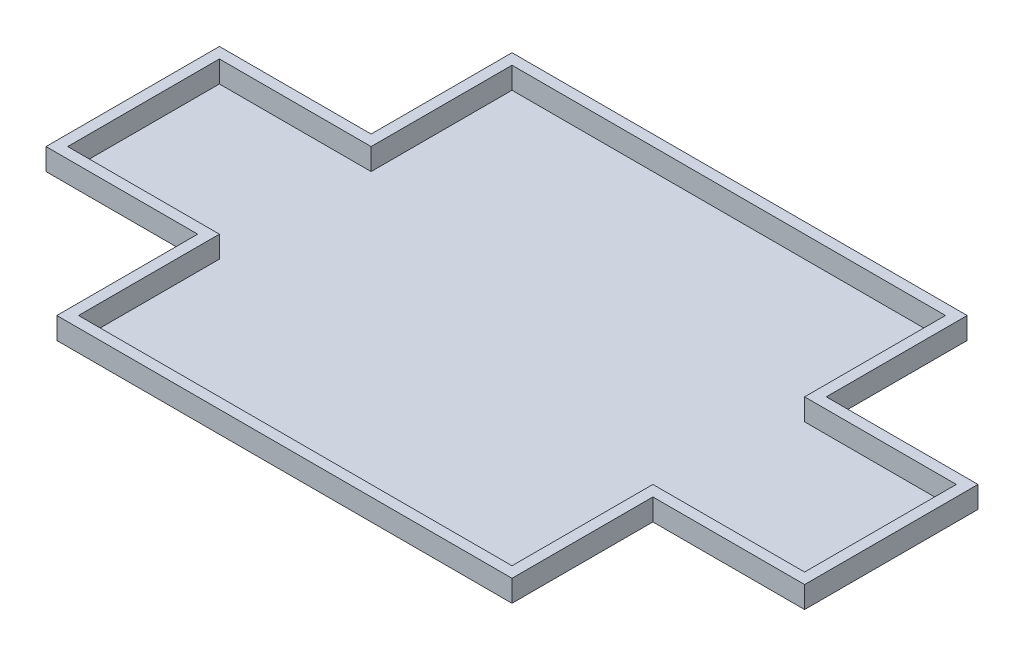
ISO-10303-21;
HEADER;
FILE_DESCRIPTION(('STEP AP214'),'2;1');
FILE_NAME('part.step','',(''),(''),'','','');
FILE_SCHEMA(('AUTOMOTIVE_DESIGN { 1 0 10303 214 1 1 1 1 }'));
ENDSEC;
DATA;
#1=APPLICATION_CONTEXT('core data for automotive mechanical design processes');
#2=APPLICATION_PROTOCOL_DEFINITION('international standard','automotive_design',2000,#1);
#3=PRODUCT_CONTEXT('',#1,'mechanical');
#4=PRODUCT('Part','Part','',(#3));
#5=PRODUCT_RELATED_PRODUCT_CATEGORY('part','',(#4));
#6=PRODUCT_DEFINITION_FORMATION('','',#4);
#7=PRODUCT_DEFINITION_CONTEXT('part definition',#1,'design');
#8=PRODUCT_DEFINITION('design','',#6,#7);
#9=PRODUCT_DEFINITION_SHAPE('','',#8);
#10=(LENGTH_UNIT() NAMED_UNIT(*) SI_UNIT(.MILLI.,.METRE.));
#11=(NAMED_UNIT(*) PLANE_ANGLE_UNIT() SI_UNIT($,.RADIAN.));
#12=(NAMED_UNIT(*) SI_UNIT($,.STERADIAN.) SOLID_ANGLE_UNIT());
#13=UNCERTAINTY_MEASURE_WITH_UNIT(LENGTH_MEASURE(1.E-05),#10,'distance_accuracy_value','');
#14=(GEOMETRIC_REPRESENTATION_CONTEXT(3) GLOBAL_UNCERTAINTY_ASSIGNED_CONTEXT((#13)) GLOBAL_UNIT_ASSIGNED_CONTEXT((#10,
#11,#12)) REPRESENTATION_CONTEXT('',''));
#15=CARTESIAN_POINT('',(0.,0.,0.));
#16=DIRECTION('',(0.,0.,1.));
#17=DIRECTION('',(1.,0.,0.));
#18=AXIS2_PLACEMENT_3D('',#15,#16,#17);
#19=CARTESIAN_POINT('',(0.,120.,0.));
#20=DIRECTION('',(0.,-1.,0.));
#21=DIRECTION('',(0.,0.,-1.));
#22=AXIS2_PLACEMENT_3D('',#19,#20,#21);
#23=PLANE('',#22);
#24=DIRECTION('',(1.,0.,0.));
#25=VECTOR('',#24,1.);
#26=CARTESIAN_POINT('',(-50.,120.,-600.));
#27=LINE('',#26,#25);
#28=CARTESIAN_POINT('',(-750.,120.,-600.));
#29=VERTEX_POINT('',#28);
#30=CARTESIAN_POINT('',(-50.,120.,-600.));
#31=VERTEX_POINT('',#30);
#32=EDGE_CURVE('E297',#29,#31,#27,.T.);
#33=ORIENTED_EDGE('',*,*,#32,.T.);
#34=DIRECTION('',(0.,0.,1.));
#35=VECTOR('',#34,1.);
#36=CARTESIAN_POINT('',(-50.,120.,49.9999999999998));
#37=LINE('',#36,#35);
#38=CARTESIAN_POINT('',(-50.,120.,49.9999999999998));
#39=VERTEX_POINT('',#38);
#40=EDGE_CURVE('E300',#31,#39,#37,.T.);
#41=ORIENTED_EDGE('',*,*,#40,.T.);
#42=DIRECTION('',(1.,0.,0.));
#43=VECTOR('',#42,1.);
#44=CARTESIAN_POINT('',(2050.,120.,49.9999999999996));
#45=LINE('',#44,#43);
#46=CARTESIAN_POINT('',(2050.,120.,49.9999999999996));
#47=VERTEX_POINT('',#46);
#48=EDGE_CURVE('E303',#39,#47,#45,.T.);
#49=ORIENTED_EDGE('',*,*,#48,.T.);
#50=DIRECTION('',(0.,0.,-1.));
#51=VECTOR('',#50,1.);
#52=CARTESIAN_POINT('',(2050.,120.,-600.));
#53=LINE('',#52,#51);
#54=CARTESIAN_POINT('',(2050.,120.,-600.));
#55=VERTEX_POINT('',#54);
#56=EDGE_CURVE('E305',#47,#55,#53,.T.);
#57=ORIENTED_EDGE('',*,*,#56,.T.);
#58=DIRECTION('',(1.,0.,0.));
#59=VECTOR('',#58,1.);
#60=CARTESIAN_POINT('',(2750.,120.,-600.));
#61=LINE('',#60,#59);
#62=CARTESIAN_POINT('',(2750.,120.,-600.));
#63=VERTEX_POINT('',#62);
#64=EDGE_CURVE('E307',#55,#63,#61,.T.);
#65=ORIENTED_EDGE('',*,*,#64,.T.);
#66=DIRECTION('',(0.,0.,-1.));
#67=VECTOR('',#66,1.);
#68=CARTESIAN_POINT('',(2750.,120.,-1400.));
#69=LINE('',#68,#67);
#70=CARTESIAN_POINT('',(2750.,120.,-1400.));
#71=VERTEX_POINT('',#70);
#72=EDGE_CURVE('E309',#63,#71,#69,.T.);
#73=ORIENTED_EDGE('',*,*,#72,.T.);
#74=DIRECTION('',(-1.,0.,0.));
#75=VECTOR('',#74,1.);
#76=CARTESIAN_POINT('',(2050.,120.,-1400.));
#77=LINE('',#76,#75);
#78=CARTESIAN_POINT('',(2050.,120.,-1400.));
#79=VERTEX_POINT('',#78);
#80=EDGE_CURVE('E311',#71,#79,#77,.T.);
#81=ORIENTED_EDGE('',*,*,#80,.T.);
#82=DIRECTION('',(0.,0.,-1.));
#83=VECTOR('',#82,1.);
#84=CARTESIAN_POINT('',(2050.,120.,-2050.));
#85=LINE('',#84,#83);
#86=CARTESIAN_POINT('',(2050.,120.,-2050.));
#87=VERTEX_POINT('',#86);
#88=EDGE_CURVE('E313',#79,#87,#85,.T.);
#89=ORIENTED_EDGE('',*,*,#88,.T.);
#90=DIRECTION('',(-1.,0.,0.));
#91=VECTOR('',#90,1.);
#92=CARTESIAN_POINT('',(-50.,120.,-2050.));
#93=LINE('',#92,#91);
#94=CARTESIAN_POINT('',(-50.,120.,-2050.));
#95=VERTEX_POINT('',#94);
#96=EDGE_CURVE('E315',#87,#95,#93,.T.);
#97=ORIENTED_EDGE('',*,*,#96,.T.);
#98=DIRECTION('',(0.,0.,1.));
#99=VECTOR('',#98,1.);
#100=CARTESIAN_POINT('',(-50.,120.,-1400.));
#101=LINE('',#100,#99);
#102=CARTESIAN_POINT('',(-50.,120.,-1400.));
#103=VERTEX_POINT('',#102);
#104=EDGE_CURVE('E317',#95,#103,#101,.T.);
#105=ORIENTED_EDGE('',*,*,#104,.T.);
#106=DIRECTION('',(-1.,0.,0.));
#107=VECTOR('',#106,1.);
#108=CARTESIAN_POINT('',(-750.,120.,-1400.));
#109=LINE('',#108,#107);
#110=CARTESIAN_POINT('',(-750.,120.,-1400.));
#111=VERTEX_POINT('',#110);
#112=EDGE_CURVE('E319',#103,#111,#109,.T.);
#113=ORIENTED_EDGE('',*,*,#112,.T.);
#114=DIRECTION('',(0.,0.,1.));
#115=VECTOR('',#114,1.);
#116=CARTESIAN_POINT('',(-750.,120.,-600.));
#117=LINE('',#116,#115);
#118=EDGE_CURVE('E321',#111,#29,#117,.T.);
#119=ORIENTED_EDGE('',*,*,#118,.T.);
#120=EDGE_LOOP('',(#33,#41,#49,#57,#65,#73,#81,#89,#97,#105,#113,#119));
#121=FACE_BOUND('',#120,.T.);
#122=DIRECTION('',(0.,0.,1.));
#123=VECTOR('',#122,1.);
#124=CARTESIAN_POINT('',(-700.,120.,-650.));
#125=LINE('',#124,#123);
#126=CARTESIAN_POINT('',(-700.,120.,-1350.));
#127=VERTEX_POINT('',#126);
#128=CARTESIAN_POINT('',(-700.,120.,-650.));
#129=VERTEX_POINT('',#128);
#130=EDGE_CURVE('E204',#127,#129,#125,.T.);
#131=ORIENTED_EDGE('',*,*,#130,.F.);
#132=DIRECTION('',(-1.,0.,0.));
#133=VECTOR('',#132,1.);
#134=CARTESIAN_POINT('',(-700.,120.,-1350.));
#135=LINE('',#134,#133);
#136=CARTESIAN_POINT('',(0.,120.,-1350.));
#137=VERTEX_POINT('',#136);
#138=EDGE_CURVE('E245',#137,#127,#135,.T.);
#139=ORIENTED_EDGE('',*,*,#138,.F.);
#140=DIRECTION('',(0.,0.,1.));
#141=VECTOR('',#140,1.);
#142=CARTESIAN_POINT('',(0.,120.,-1350.));
#143=LINE('',#142,#141);
#144=CARTESIAN_POINT('',(0.,120.,-2000.));
#145=VERTEX_POINT('',#144);
#146=EDGE_CURVE('E243',#145,#137,#143,.T.);
#147=ORIENTED_EDGE('',*,*,#146,.F.);
#148=DIRECTION('',(-1.,0.,0.));
#149=VECTOR('',#148,1.);
#150=CARTESIAN_POINT('',(0.,120.,-2000.));
#151=LINE('',#150,#149);
#152=CARTESIAN_POINT('',(2000.,120.,-2000.));
#153=VERTEX_POINT('',#152);
#154=EDGE_CURVE('E241',#153,#145,#151,.T.);
#155=ORIENTED_EDGE('',*,*,#154,.F.);
#156=DIRECTION('',(0.,0.,-1.));
#157=VECTOR('',#156,1.);
#158=CARTESIAN_POINT('',(2000.,120.,-2000.));
#159=LINE('',#158,#157);
#160=CARTESIAN_POINT('',(2000.,120.,-1350.));
#161=VERTEX_POINT('',#160);
#162=EDGE_CURVE('E239',#161,#153,#159,.T.);
#163=ORIENTED_EDGE('',*,*,#162,.F.);
#164=DIRECTION('',(-1.,0.,0.));
#165=VECTOR('',#164,1.);
#166=CARTESIAN_POINT('',(2000.,120.,-1350.));
#167=LINE('',#166,#165);
#168=CARTESIAN_POINT('',(2700.,120.,-1350.));
#169=VERTEX_POINT('',#168);
#170=EDGE_CURVE('E237',#169,#161,#167,.T.);
#171=ORIENTED_EDGE('',*,*,#170,.F.);
#172=DIRECTION('',(0.,0.,-1.));
#173=VECTOR('',#172,1.);
#174=CARTESIAN_POINT('',(2700.,120.,-1350.));
#175=LINE('',#174,#173);
#176=CARTESIAN_POINT('',(2700.,120.,-650.));
#177=VERTEX_POINT('',#176);
#178=EDGE_CURVE('E235',#177,#169,#175,.T.);
#179=ORIENTED_EDGE('',*,*,#178,.F.);
#180=DIRECTION('',(1.,0.,0.));
#181=VECTOR('',#180,1.);
#182=CARTESIAN_POINT('',(2700.,120.,-650.));
#183=LINE('',#182,#181);
#184=CARTESIAN_POINT('',(2000.,120.,-650.));
#185=VERTEX_POINT('',#184);
#186=EDGE_CURVE('E233',#185,#177,#183,.T.);
#187=ORIENTED_EDGE('',*,*,#186,.F.);
#188=DIRECTION('',(0.,0.,-1.));
#189=VECTOR('',#188,1.);
#190=CARTESIAN_POINT('',(2000.,120.,-650.));
#191=LINE('',#190,#189);
#192=CARTESIAN_POINT('',(2000.,120.,0.));
#193=VERTEX_POINT('',#192);
#194=EDGE_CURVE('E231',#193,#185,#191,.T.);
#195=ORIENTED_EDGE('',*,*,#194,.F.);
#196=DIRECTION('',(1.,0.,0.));
#197=VECTOR('',#196,1.);
#198=CARTESIAN_POINT('',(2000.,120.,0.));
#199=LINE('',#198,#197);
#200=CARTESIAN_POINT('',(0.,120.,0.));
#201=VERTEX_POINT('',#200);
#202=EDGE_CURVE('E227',#201,#193,#199,.T.);
#203=ORIENTED_EDGE('',*,*,#202,.F.);
#204=DIRECTION('',(0.,0.,1.));
#205=VECTOR('',#204,1.);
#206=CARTESIAN_POINT('',(0.,120.,0.));
#207=LINE('',#206,#205);
#208=CARTESIAN_POINT('',(0.,120.,-650.));
#209=VERTEX_POINT('',#208);
#210=EDGE_CURVE('E225',#209,#201,#207,.T.);
#211=ORIENTED_EDGE('',*,*,#210,.F.);
#212=DIRECTION('',(1.,0.,0.));
#213=VECTOR('',#212,1.);
#214=CARTESIAN_POINT('',(0.,120.,-650.));
#215=LINE('',#214,#213);
#216=EDGE_CURVE('E212',#129,#209,#215,.T.);
#217=ORIENTED_EDGE('',*,*,#216,.F.);
#218=EDGE_LOOP('',(#131,#139,#147,#155,#163,#171,#179,#187,#195,#203,#211,#217));
#219=FACE_BOUND('',#218,.T.);
#220=ADVANCED_FACE('F43',(#121,#219),#23,.F.);
#221=CARTESIAN_POINT('',(0.,20.,0.));
#222=DIRECTION('',(0.,-1.,0.));
#223=DIRECTION('',(0.,0.,-1.));
#224=AXIS2_PLACEMENT_3D('',#221,#222,#223);
#225=PLANE('',#224);
#226=DIRECTION('',(1.,0.,0.));
#227=VECTOR('',#226,1.);
#228=CARTESIAN_POINT('',(-50.,20.,-600.));
#229=LINE('',#228,#227);
#230=CARTESIAN_POINT('',(-750.,20.,-600.));
#231=VERTEX_POINT('',#230);
#232=CARTESIAN_POINT('',(-50.,20.,-600.));
#233=VERTEX_POINT('',#232);
#234=EDGE_CURVE('E220',#231,#233,#229,.T.);
#235=ORIENTED_EDGE('',*,*,#234,.F.);
#236=DIRECTION('',(0.,0.,1.));
#237=VECTOR('',#236,1.);
#238=CARTESIAN_POINT('',(-750.,20.,-600.));
#239=LINE('',#238,#237);
#240=CARTESIAN_POINT('',(-750.,20.,-1400.));
#241=VERTEX_POINT('',#240);
#242=EDGE_CURVE('E301',#241,#231,#239,.T.);
#243=ORIENTED_EDGE('',*,*,#242,.F.);
#244=DIRECTION('',(-1.,0.,0.));
#245=VECTOR('',#244,1.);
#246=CARTESIAN_POINT('',(-750.,20.,-1400.));
#247=LINE('',#246,#245);
#248=CARTESIAN_POINT('',(-50.,20.,-1400.));
#249=VERTEX_POINT('',#248);
#250=EDGE_CURVE('E344',#249,#241,#247,.T.);
#251=ORIENTED_EDGE('',*,*,#250,.F.);
#252=DIRECTION('',(0.,0.,1.));
#253=VECTOR('',#252,1.);
#254=CARTESIAN_POINT('',(-50.,20.,-1400.));
#255=LINE('',#254,#253);
#256=CARTESIAN_POINT('',(-50.,20.,-2050.));
#257=VERTEX_POINT('',#256);
#258=EDGE_CURVE('E342',#257,#249,#255,.T.);
#259=ORIENTED_EDGE('',*,*,#258,.F.);
#260=DIRECTION('',(-1.,0.,0.));
#261=VECTOR('',#260,1.);
#262=CARTESIAN_POINT('',(-50.,20.,-2050.));
#263=LINE('',#262,#261);
#264=CARTESIAN_POINT('',(2050.,20.,-2050.));
#265=VERTEX_POINT('',#264);
#266=EDGE_CURVE('E340',#265,#257,#263,.T.);
#267=ORIENTED_EDGE('',*,*,#266,.F.);
#268=DIRECTION('',(0.,0.,-1.));
#269=VECTOR('',#268,1.);
#270=CARTESIAN_POINT('',(2050.,20.,-2050.));
#271=LINE('',#270,#269);
#272=CARTESIAN_POINT('',(2050.,20.,-1400.));
#273=VERTEX_POINT('',#272);
#274=EDGE_CURVE('E338',#273,#265,#271,.T.);
#275=ORIENTED_EDGE('',*,*,#274,.F.);
#276=DIRECTION('',(-1.,0.,0.));
#277=VECTOR('',#276,1.);
#278=CARTESIAN_POINT('',(2050.,20.,-1400.));
#279=LINE('',#278,#277);
#280=CARTESIAN_POINT('',(2750.,20.,-1400.));
#281=VERTEX_POINT('',#280);
#282=EDGE_CURVE('E336',#281,#273,#279,.T.);
#283=ORIENTED_EDGE('',*,*,#282,.F.);
#284=DIRECTION('',(0.,0.,-1.));
#285=VECTOR('',#284,1.);
#286=CARTESIAN_POINT('',(2750.,20.,-1400.));
#287=LINE('',#286,#285);
#288=CARTESIAN_POINT('',(2750.,20.,-600.));
#289=VERTEX_POINT('',#288);
#290=EDGE_CURVE('E334',#289,#281,#287,.T.);
#291=ORIENTED_EDGE('',*,*,#290,.F.);
#292=DIRECTION('',(1.,0.,0.));
#293=VECTOR('',#292,1.);
#294=CARTESIAN_POINT('',(2750.,20.,-600.));
#295=LINE('',#294,#293);
#296=CARTESIAN_POINT('',(2050.,20.,-600.));
#297=VERTEX_POINT('',#296);
#298=EDGE_CURVE('E332',#297,#289,#295,.T.);
#299=ORIENTED_EDGE('',*,*,#298,.F.);
#300=DIRECTION('',(0.,0.,-1.));
#301=VECTOR('',#300,1.);
#302=CARTESIAN_POINT('',(2050.,20.,-600.));
#303=LINE('',#302,#301);
#304=CARTESIAN_POINT('',(2050.,20.,49.9999999999996));
#305=VERTEX_POINT('',#304);
#306=EDGE_CURVE('E330',#305,#297,#303,.T.);
#307=ORIENTED_EDGE('',*,*,#306,.F.);
#308=DIRECTION('',(1.,0.,0.));
#309=VECTOR('',#308,1.);
#310=CARTESIAN_POINT('',(2050.,20.,49.9999999999996));
#311=LINE('',#310,#309);
#312=CARTESIAN_POINT('',(-50.,20.,49.9999999999998));
#313=VERTEX_POINT('',#312);
#314=EDGE_CURVE('E328',#313,#305,#311,.T.);
#315=ORIENTED_EDGE('',*,*,#314,.F.);
#316=DIRECTION('',(0.,0.,1.));
#317=VECTOR('',#316,1.);
#318=CARTESIAN_POINT('',(-50.,20.,49.9999999999998));
#319=LINE('',#318,#317);
#320=EDGE_CURVE('E326',#233,#313,#319,.T.);
#321=ORIENTED_EDGE('',*,*,#320,.F.);
#322=EDGE_LOOP('',(#235,#243,#251,#259,#267,#275,#283,#291,#299,#307,#315,#321));
#323=FACE_BOUND('',#322,.T.);
#324=DIRECTION('',(-1.,0.,0.));
#325=VECTOR('',#324,1.);
#326=CARTESIAN_POINT('',(-700.,20.,-1350.));
#327=LINE('',#326,#325);
#328=CARTESIAN_POINT('',(0.,20.,-1350.));
#329=VERTEX_POINT('',#328);
#330=CARTESIAN_POINT('',(-700.,20.,-1350.));
#331=VERTEX_POINT('',#330);
#332=EDGE_CURVE('E213',#329,#331,#327,.T.);
#333=ORIENTED_EDGE('',*,*,#332,.T.);
#334=DIRECTION('',(0.,0.,1.));
#335=VECTOR('',#334,1.);
#336=CARTESIAN_POINT('',(-700.,20.,-650.));
#337=LINE('',#336,#335);
#338=CARTESIAN_POINT('',(-700.,20.,-650.));
#339=VERTEX_POINT('',#338);
#340=EDGE_CURVE('E66',#331,#339,#337,.T.);
#341=ORIENTED_EDGE('',*,*,#340,.T.);
#342=DIRECTION('',(1.,0.,0.));
#343=VECTOR('',#342,1.);
#344=CARTESIAN_POINT('',(0.,20.,-650.));
#345=LINE('',#344,#343);
#346=CARTESIAN_POINT('',(0.,20.,-650.));
#347=VERTEX_POINT('',#346);
#348=EDGE_CURVE('E219',#339,#347,#345,.T.);
#349=ORIENTED_EDGE('',*,*,#348,.T.);
#350=DIRECTION('',(0.,0.,1.));
#351=VECTOR('',#350,1.);
#352=CARTESIAN_POINT('',(0.,20.,0.));
#353=LINE('',#352,#351);
#354=CARTESIAN_POINT('',(0.,20.,0.));
#355=VERTEX_POINT('',#354);
#356=EDGE_CURVE('E249',#347,#355,#353,.T.);
#357=ORIENTED_EDGE('',*,*,#356,.T.);
#358=DIRECTION('',(1.,0.,0.));
#359=VECTOR('',#358,1.);
#360=CARTESIAN_POINT('',(2000.,20.,0.));
#361=LINE('',#360,#359);
#362=CARTESIAN_POINT('',(2000.,20.,0.));
#363=VERTEX_POINT('',#362);
#364=EDGE_CURVE('E252',#355,#363,#361,.T.);
#365=ORIENTED_EDGE('',*,*,#364,.T.);
#366=DIRECTION('',(0.,0.,-1.));
#367=VECTOR('',#366,1.);
#368=CARTESIAN_POINT('',(2000.,20.,-650.));
#369=LINE('',#368,#367);
#370=CARTESIAN_POINT('',(2000.,20.,-650.));
#371=VERTEX_POINT('',#370);
#372=EDGE_CURVE('E255',#363,#371,#369,.T.);
#373=ORIENTED_EDGE('',*,*,#372,.T.);
#374=DIRECTION('',(1.,0.,0.));
#375=VECTOR('',#374,1.);
#376=CARTESIAN_POINT('',(2700.,20.,-650.));
#377=LINE('',#376,#375);
#378=CARTESIAN_POINT('',(2700.,20.,-650.));
#379=VERTEX_POINT('',#378);
#380=EDGE_CURVE('E258',#371,#379,#377,.T.);
#381=ORIENTED_EDGE('',*,*,#380,.T.);
#382=DIRECTION('',(0.,0.,-1.));
#383=VECTOR('',#382,1.);
#384=CARTESIAN_POINT('',(2700.,20.,-1350.));
#385=LINE('',#384,#383);
#386=CARTESIAN_POINT('',(2700.,20.,-1350.));
#387=VERTEX_POINT('',#386);
#388=EDGE_CURVE('E261',#379,#387,#385,.T.);
#389=ORIENTED_EDGE('',*,*,#388,.T.);
#390=DIRECTION('',(-1.,0.,0.));
#391=VECTOR('',#390,1.);
#392=CARTESIAN_POINT('',(2000.,20.,-1350.));
#393=LINE('',#392,#391);
#394=CARTESIAN_POINT('',(2000.,20.,-1350.));
#395=VERTEX_POINT('',#394);
#396=EDGE_CURVE('E264',#387,#395,#393,.T.);
#397=ORIENTED_EDGE('',*,*,#396,.T.);
#398=DIRECTION('',(0.,0.,-1.));
#399=VECTOR('',#398,1.);
#400=CARTESIAN_POINT('',(2000.,20.,-2000.));
#401=LINE('',#400,#399);
#402=CARTESIAN_POINT('',(2000.,20.,-2000.));
#403=VERTEX_POINT('',#402);
#404=EDGE_CURVE('E267',#395,#403,#401,.T.);
#405=ORIENTED_EDGE('',*,*,#404,.T.);
#406=DIRECTION('',(-1.,0.,0.));
#407=VECTOR('',#406,1.);
#408=CARTESIAN_POINT('',(0.,20.,-2000.));
#409=LINE('',#408,#407);
#410=CARTESIAN_POINT('',(0.,20.,-2000.));
#411=VERTEX_POINT('',#410);
#412=EDGE_CURVE('E270',#403,#411,#409,.T.);
#413=ORIENTED_EDGE('',*,*,#412,.T.);
#414=DIRECTION('',(0.,0.,1.));
#415=VECTOR('',#414,1.);
#416=CARTESIAN_POINT('',(0.,20.,-1350.));
#417=LINE('',#416,#415);
#418=EDGE_CURVE('E273',#411,#329,#417,.T.);
#419=ORIENTED_EDGE('',*,*,#418,.T.);
#420=EDGE_LOOP('',(#333,#341,#349,#357,#365,#373,#381,#389,#397,#405,#413,#419));
#421=FACE_BOUND('',#420,.T.);
#422=ADVANCED_FACE('F386',(#323,#421),#225,.T.);
#423=CARTESIAN_POINT('',(-50.,120.,-600.));
#424=DIRECTION('',(0.,0.,-1.));
#425=DIRECTION('',(-1.,0.,0.));
#426=AXIS2_PLACEMENT_3D('',#423,#424,#425);
#427=PLANE('',#426);
#428=ORIENTED_EDGE('',*,*,#234,.T.);
#429=DIRECTION('',(0.,-1.,0.));
#430=VECTOR('',#429,1.);
#431=CARTESIAN_POINT('',(-50.,120.,-600.));
#432=LINE('',#431,#430);
#433=EDGE_CURVE('E12',#31,#233,#432,.T.);
#434=ORIENTED_EDGE('',*,*,#433,.F.);
#435=ORIENTED_EDGE('',*,*,#32,.F.);
#436=DIRECTION('',(0.,-1.,0.));
#437=VECTOR('',#436,1.);
#438=CARTESIAN_POINT('',(-750.,120.,-600.));
#439=LINE('',#438,#437);
#440=EDGE_CURVE('E323',#29,#231,#439,.T.);
#441=ORIENTED_EDGE('',*,*,#440,.T.);
#442=EDGE_LOOP('',(#428,#434,#435,#441));
#443=FACE_BOUND('',#442,.T.);
#444=ADVANCED_FACE('F45',(#443),#427,.F.);
#445=CARTESIAN_POINT('',(-50.,120.,49.9999999999998));
#446=DIRECTION('',(1.,0.,0.));
#447=DIRECTION('',(0.,0.,-1.));
#448=AXIS2_PLACEMENT_3D('',#445,#446,#447);
#449=PLANE('',#448);
#450=ORIENTED_EDGE('',*,*,#320,.T.);
#451=DIRECTION('',(0.,-1.,0.));
#452=VECTOR('',#451,1.);
#453=CARTESIAN_POINT('',(-50.,120.,49.9999999999998));
#454=LINE('',#453,#452);
#455=EDGE_CURVE('E51',#39,#313,#454,.T.);
#456=ORIENTED_EDGE('',*,*,#455,.F.);
#457=ORIENTED_EDGE('',*,*,#40,.F.);
#458=ORIENTED_EDGE('',*,*,#433,.T.);
#459=EDGE_LOOP('',(#450,#456,#457,#458));
#460=FACE_BOUND('',#459,.T.);
#461=ADVANCED_FACE('F403',(#460),#449,.F.);
#462=CARTESIAN_POINT('',(2050.,120.,49.9999999999996));
#463=DIRECTION('',(0.,0.,-1.));
#464=DIRECTION('',(-1.,0.,0.));
#465=AXIS2_PLACEMENT_3D('',#462,#463,#464);
#466=PLANE('',#465);
#467=ORIENTED_EDGE('',*,*,#314,.T.);
#468=DIRECTION('',(0.,-1.,0.));
#469=VECTOR('',#468,1.);
#470=CARTESIAN_POINT('',(2050.,120.,49.9999999999996));
#471=LINE('',#470,#469);
#472=EDGE_CURVE('E373',#47,#305,#471,.T.);
#473=ORIENTED_EDGE('',*,*,#472,.F.);
#474=ORIENTED_EDGE('',*,*,#48,.F.);
#475=ORIENTED_EDGE('',*,*,#455,.T.);
#476=EDGE_LOOP('',(#467,#473,#474,#475));
#477=FACE_BOUND('',#476,.T.);
#478=ADVANCED_FACE('F380',(#477),#466,.F.);
#479=CARTESIAN_POINT('',(2050.,120.,-600.));
#480=DIRECTION('',(-1.,0.,0.));
#481=DIRECTION('',(0.,0.,1.));
#482=AXIS2_PLACEMENT_3D('',#479,#480,#481);
#483=PLANE('',#482);
#484=ORIENTED_EDGE('',*,*,#306,.T.);
#485=DIRECTION('',(0.,-1.,0.));
#486=VECTOR('',#485,1.);
#487=CARTESIAN_POINT('',(2050.,120.,-600.));
#488=LINE('',#487,#486);
#489=EDGE_CURVE('E370',#55,#297,#488,.T.);
#490=ORIENTED_EDGE('',*,*,#489,.F.);
#491=ORIENTED_EDGE('',*,*,#56,.F.);
#492=ORIENTED_EDGE('',*,*,#472,.T.);
#493=EDGE_LOOP('',(#484,#490,#491,#492));
#494=FACE_BOUND('',#493,.T.);
#495=ADVANCED_FACE('F392',(#494),#483,.F.);
#496=CARTESIAN_POINT('',(2750.,120.,-600.));
#497=DIRECTION('',(0.,0.,-1.));
#498=DIRECTION('',(-1.,0.,0.));
#499=AXIS2_PLACEMENT_3D('',#496,#497,#498);
#500=PLANE('',#499);
#501=ORIENTED_EDGE('',*,*,#298,.T.);
#502=DIRECTION('',(0.,-1.,0.));
#503=VECTOR('',#502,1.);
#504=CARTESIAN_POINT('',(2750.,120.,-600.));
#505=LINE('',#504,#503);
#506=EDGE_CURVE('E367',#63,#289,#505,.T.);
#507=ORIENTED_EDGE('',*,*,#506,.F.);
#508=ORIENTED_EDGE('',*,*,#64,.F.);
#509=ORIENTED_EDGE('',*,*,#489,.T.);
#510=EDGE_LOOP('',(#501,#507,#508,#509));
#511=FACE_BOUND('',#510,.T.);
#512=ADVANCED_FACE('F396',(#511),#500,.F.);
#513=CARTESIAN_POINT('',(2750.,120.,-1400.));
#514=DIRECTION('',(-1.,0.,0.));
#515=DIRECTION('',(0.,0.,1.));
#516=AXIS2_PLACEMENT_3D('',#513,#514,#515);
#517=PLANE('',#516);
#518=ORIENTED_EDGE('',*,*,#290,.T.);
#519=DIRECTION('',(0.,-1.,0.));
#520=VECTOR('',#519,1.);
#521=CARTESIAN_POINT('',(2750.,120.,-1400.));
#522=LINE('',#521,#520);
#523=EDGE_CURVE('E364',#71,#281,#522,.T.);
#524=ORIENTED_EDGE('',*,*,#523,.F.);
#525=ORIENTED_EDGE('',*,*,#72,.F.);
#526=ORIENTED_EDGE('',*,*,#506,.T.);
#527=EDGE_LOOP('',(#518,#524,#525,#526));
#528=FACE_BOUND('',#527,.T.);
#529=ADVANCED_FACE('F436',(#528),#517,.F.);
#530=CARTESIAN_POINT('',(2050.,120.,-1400.));
#531=DIRECTION('',(0.,0.,1.));
#532=DIRECTION('',(1.,0.,0.));
#533=AXIS2_PLACEMENT_3D('',#530,#531,#532);
#534=PLANE('',#533);
#535=ORIENTED_EDGE('',*,*,#282,.T.);
#536=DIRECTION('',(0.,-1.,0.));
#537=VECTOR('',#536,1.);
#538=CARTESIAN_POINT('',(2050.,120.,-1400.));
#539=LINE('',#538,#537);
#540=EDGE_CURVE('E361',#79,#273,#539,.T.);
#541=ORIENTED_EDGE('',*,*,#540,.F.);
#542=ORIENTED_EDGE('',*,*,#80,.F.);
#543=ORIENTED_EDGE('',*,*,#523,.T.);
#544=EDGE_LOOP('',(#535,#541,#542,#543));
#545=FACE_BOUND('',#544,.T.);
#546=ADVANCED_FACE('F434',(#545),#534,.F.);
#547=CARTESIAN_POINT('',(2050.,120.,-2050.));
#548=DIRECTION('',(-1.,0.,0.));
#549=DIRECTION('',(0.,0.,1.));
#550=AXIS2_PLACEMENT_3D('',#547,#548,#549);
#551=PLANE('',#550);
#552=ORIENTED_EDGE('',*,*,#274,.T.);
#553=DIRECTION('',(0.,-1.,0.));
#554=VECTOR('',#553,1.);
#555=CARTESIAN_POINT('',(2050.,120.,-2050.));
#556=LINE('',#555,#554);
#557=EDGE_CURVE('E358',#87,#265,#556,.T.);
#558=ORIENTED_EDGE('',*,*,#557,.F.);
#559=ORIENTED_EDGE('',*,*,#88,.F.);
#560=ORIENTED_EDGE('',*,*,#540,.T.);
#561=EDGE_LOOP('',(#552,#558,#559,#560));
#562=FACE_BOUND('',#561,.T.);
#563=ADVANCED_FACE('F430',(#562),#551,.F.);
#564=CARTESIAN_POINT('',(-50.,120.,-2050.));
#565=DIRECTION('',(0.,0.,1.));
#566=DIRECTION('',(1.,0.,0.));
#567=AXIS2_PLACEMENT_3D('',#564,#565,#566);
#568=PLANE('',#567);
#569=ORIENTED_EDGE('',*,*,#266,.T.);
#570=DIRECTION('',(0.,-1.,0.));
#571=VECTOR('',#570,1.);
#572=CARTESIAN_POINT('',(-50.,120.,-2050.));
#573=LINE('',#572,#571);
#574=EDGE_CURVE('E355',#95,#257,#573,.T.);
#575=ORIENTED_EDGE('',*,*,#574,.F.);
#576=ORIENTED_EDGE('',*,*,#96,.F.);
#577=ORIENTED_EDGE('',*,*,#557,.T.);
#578=EDGE_LOOP('',(#569,#575,#576,#577));
#579=FACE_BOUND('',#578,.T.);
#580=ADVANCED_FACE('F425',(#579),#568,.F.);
#581=CARTESIAN_POINT('',(-50.,120.,-1400.));
#582=DIRECTION('',(1.,0.,0.));
#583=DIRECTION('',(0.,0.,-1.));
#584=AXIS2_PLACEMENT_3D('',#581,#582,#583);
#585=PLANE('',#584);
#586=ORIENTED_EDGE('',*,*,#258,.T.);
#587=DIRECTION('',(0.,-1.,0.));
#588=VECTOR('',#587,1.);
#589=CARTESIAN_POINT('',(-50.,120.,-1400.));
#590=LINE('',#589,#588);
#591=EDGE_CURVE('E352',#103,#249,#590,.T.);
#592=ORIENTED_EDGE('',*,*,#591,.F.);
#593=ORIENTED_EDGE('',*,*,#104,.F.);
#594=ORIENTED_EDGE('',*,*,#574,.T.);
#595=EDGE_LOOP('',(#586,#592,#593,#594));
#596=FACE_BOUND('',#595,.T.);
#597=ADVANCED_FACE('F419',(#596),#585,.F.);
#598=CARTESIAN_POINT('',(-750.,120.,-1400.));
#599=DIRECTION('',(0.,0.,1.));
#600=DIRECTION('',(1.,0.,0.));
#601=AXIS2_PLACEMENT_3D('',#598,#599,#600);
#602=PLANE('',#601);
#603=ORIENTED_EDGE('',*,*,#250,.T.);
#604=DIRECTION('',(0.,-1.,0.));
#605=VECTOR('',#604,1.);
#606=CARTESIAN_POINT('',(-750.,120.,-1400.));
#607=LINE('',#606,#605);
#608=EDGE_CURVE('E349',#111,#241,#607,.T.);
#609=ORIENTED_EDGE('',*,*,#608,.F.);
#610=ORIENTED_EDGE('',*,*,#112,.F.);
#611=ORIENTED_EDGE('',*,*,#591,.T.);
#612=EDGE_LOOP('',(#603,#609,#610,#611));
#613=FACE_BOUND('',#612,.T.);
#614=ADVANCED_FACE('F415',(#613),#602,.F.);
#615=CARTESIAN_POINT('',(-750.,120.,-600.));
#616=DIRECTION('',(1.,0.,0.));
#617=DIRECTION('',(0.,0.,-1.));
#618=AXIS2_PLACEMENT_3D('',#615,#616,#617);
#619=PLANE('',#618);
#620=ORIENTED_EDGE('',*,*,#242,.T.);
#621=ORIENTED_EDGE('',*,*,#440,.F.);
#622=ORIENTED_EDGE('',*,*,#118,.F.);
#623=ORIENTED_EDGE('',*,*,#608,.T.);
#624=EDGE_LOOP('',(#620,#621,#622,#623));
#625=FACE_BOUND('',#624,.T.);
#626=ADVANCED_FACE('F410',(#625),#619,.F.);
#627=CARTESIAN_POINT('',(-700.,120.,-650.));
#628=DIRECTION('',(1.,0.,0.));
#629=DIRECTION('',(0.,0.,-1.));
#630=AXIS2_PLACEMENT_3D('',#627,#628,#629);
#631=PLANE('',#630);
#632=ORIENTED_EDGE('',*,*,#340,.F.);
#633=DIRECTION('',(0.,-1.,0.));
#634=VECTOR('',#633,1.);
#635=CARTESIAN_POINT('',(-700.,120.,-1350.));
#636=LINE('',#635,#634);
#637=EDGE_CURVE('E208',#127,#331,#636,.T.);
#638=ORIENTED_EDGE('',*,*,#637,.F.);
#639=ORIENTED_EDGE('',*,*,#130,.T.);
#640=DIRECTION('',(0.,-1.,0.));
#641=VECTOR('',#640,1.);
#642=CARTESIAN_POINT('',(-700.,120.,-650.));
#643=LINE('',#642,#641);
#644=EDGE_CURVE('E207',#129,#339,#643,.T.);
#645=ORIENTED_EDGE('',*,*,#644,.T.);
#646=EDGE_LOOP('',(#632,#638,#639,#645));
#647=FACE_BOUND('',#646,.T.);
#648=ADVANCED_FACE('F206',(#647),#631,.T.);
#649=CARTESIAN_POINT('',(0.,120.,-650.));
#650=DIRECTION('',(0.,0.,-1.));
#651=DIRECTION('',(-1.,0.,0.));
#652=AXIS2_PLACEMENT_3D('',#649,#650,#651);
#653=PLANE('',#652);
#654=ORIENTED_EDGE('',*,*,#348,.F.);
#655=ORIENTED_EDGE('',*,*,#644,.F.);
#656=ORIENTED_EDGE('',*,*,#216,.T.);
#657=DIRECTION('',(0.,-1.,0.));
#658=VECTOR('',#657,1.);
#659=CARTESIAN_POINT('',(0.,120.,-650.));
#660=LINE('',#659,#658);
#661=EDGE_CURVE('E221',#209,#347,#660,.T.);
#662=ORIENTED_EDGE('',*,*,#661,.T.);
#663=EDGE_LOOP('',(#654,#655,#656,#662));
#664=FACE_BOUND('',#663,.T.);
#665=ADVANCED_FACE('F216',(#664),#653,.T.);
#666=CARTESIAN_POINT('',(0.,120.,0.));
#667=DIRECTION('',(1.,0.,0.));
#668=DIRECTION('',(0.,0.,-1.));
#669=AXIS2_PLACEMENT_3D('',#666,#667,#668);
#670=PLANE('',#669);
#671=ORIENTED_EDGE('',*,*,#356,.F.);
#672=ORIENTED_EDGE('',*,*,#661,.F.);
#673=ORIENTED_EDGE('',*,*,#210,.T.);
#674=DIRECTION('',(0.,-1.,0.));
#675=VECTOR('',#674,1.);
#676=CARTESIAN_POINT('',(0.,120.,0.));
#677=LINE('',#676,#675);
#678=EDGE_CURVE('E294',#201,#355,#677,.T.);
#679=ORIENTED_EDGE('',*,*,#678,.T.);
#680=EDGE_LOOP('',(#671,#672,#673,#679));
#681=FACE_BOUND('',#680,.T.);
#682=ADVANCED_FACE('F494',(#681),#670,.T.);
#683=CARTESIAN_POINT('',(2000.,120.,0.));
#684=DIRECTION('',(0.,0.,-1.));
#685=DIRECTION('',(-1.,0.,0.));
#686=AXIS2_PLACEMENT_3D('',#683,#684,#685);
#687=PLANE('',#686);
#688=ORIENTED_EDGE('',*,*,#364,.F.);
#689=ORIENTED_EDGE('',*,*,#678,.F.);
#690=ORIENTED_EDGE('',*,*,#202,.T.);
#691=DIRECTION('',(0.,-1.,0.));
#692=VECTOR('',#691,1.);
#693=CARTESIAN_POINT('',(2000.,120.,0.));
#694=LINE('',#693,#692);
#695=EDGE_CURVE('E292',#193,#363,#694,.T.);
#696=ORIENTED_EDGE('',*,*,#695,.T.);
#697=EDGE_LOOP('',(#688,#689,#690,#696));
#698=FACE_BOUND('',#697,.T.);
#699=ADVANCED_FACE('F500',(#698),#687,.T.);
#700=CARTESIAN_POINT('',(2000.,120.,-650.));
#701=DIRECTION('',(-1.,0.,0.));
#702=DIRECTION('',(0.,0.,1.));
#703=AXIS2_PLACEMENT_3D('',#700,#701,#702);
#704=PLANE('',#703);
#705=ORIENTED_EDGE('',*,*,#372,.F.);
#706=ORIENTED_EDGE('',*,*,#695,.F.);
#707=ORIENTED_EDGE('',*,*,#194,.T.);
#708=DIRECTION('',(0.,-1.,0.));
#709=VECTOR('',#708,1.);
#710=CARTESIAN_POINT('',(2000.,120.,-650.));
#711=LINE('',#710,#709);
#712=EDGE_CURVE('E290',#185,#371,#711,.T.);
#713=ORIENTED_EDGE('',*,*,#712,.T.);
#714=EDGE_LOOP('',(#705,#706,#707,#713));
#715=FACE_BOUND('',#714,.T.);
#716=ADVANCED_FACE('F508',(#715),#704,.T.);
#717=CARTESIAN_POINT('',(2700.,120.,-650.));
#718=DIRECTION('',(0.,0.,-1.));
#719=DIRECTION('',(-1.,0.,0.));
#720=AXIS2_PLACEMENT_3D('',#717,#718,#719);
#721=PLANE('',#720);
#722=ORIENTED_EDGE('',*,*,#380,.F.);
#723=ORIENTED_EDGE('',*,*,#712,.F.);
#724=ORIENTED_EDGE('',*,*,#186,.T.);
#725=DIRECTION('',(0.,-1.,0.));
#726=VECTOR('',#725,1.);
#727=CARTESIAN_POINT('',(2700.,120.,-650.));
#728=LINE('',#727,#726);
#729=EDGE_CURVE('E288',#177,#379,#728,.T.);
#730=ORIENTED_EDGE('',*,*,#729,.T.);
#731=EDGE_LOOP('',(#722,#723,#724,#730));
#732=FACE_BOUND('',#731,.T.);
#733=ADVANCED_FACE('F516',(#732),#721,.T.);
#734=CARTESIAN_POINT('',(2700.,120.,-1350.));
#735=DIRECTION('',(-1.,0.,0.));
#736=DIRECTION('',(0.,0.,1.));
#737=AXIS2_PLACEMENT_3D('',#734,#735,#736);
#738=PLANE('',#737);
#739=ORIENTED_EDGE('',*,*,#388,.F.);
#740=ORIENTED_EDGE('',*,*,#729,.F.);
#741=ORIENTED_EDGE('',*,*,#178,.T.);
#742=DIRECTION('',(0.,-1.,0.));
#743=VECTOR('',#742,1.);
#744=CARTESIAN_POINT('',(2700.,120.,-1350.));
#745=LINE('',#744,#743);
#746=EDGE_CURVE('E286',#169,#387,#745,.T.);
#747=ORIENTED_EDGE('',*,*,#746,.T.);
#748=EDGE_LOOP('',(#739,#740,#741,#747));
#749=FACE_BOUND('',#748,.T.);
#750=ADVANCED_FACE('F524',(#749),#738,.T.);
#751=CARTESIAN_POINT('',(2000.,120.,-1350.));
#752=DIRECTION('',(0.,0.,1.));
#753=DIRECTION('',(1.,0.,0.));
#754=AXIS2_PLACEMENT_3D('',#751,#752,#753);
#755=PLANE('',#754);
#756=ORIENTED_EDGE('',*,*,#396,.F.);
#757=ORIENTED_EDGE('',*,*,#746,.F.);
#758=ORIENTED_EDGE('',*,*,#170,.T.);
#759=DIRECTION('',(0.,-1.,0.));
#760=VECTOR('',#759,1.);
#761=CARTESIAN_POINT('',(2000.,120.,-1350.));
#762=LINE('',#761,#760);
#763=EDGE_CURVE('E284',#161,#395,#762,.T.);
#764=ORIENTED_EDGE('',*,*,#763,.T.);
#765=EDGE_LOOP('',(#756,#757,#758,#764));
#766=FACE_BOUND('',#765,.T.);
#767=ADVANCED_FACE('F532',(#766),#755,.T.);
#768=CARTESIAN_POINT('',(2000.,120.,-2000.));
#769=DIRECTION('',(-1.,0.,0.));
#770=DIRECTION('',(0.,0.,1.));
#771=AXIS2_PLACEMENT_3D('',#768,#769,#770);
#772=PLANE('',#771);
#773=ORIENTED_EDGE('',*,*,#404,.F.);
#774=ORIENTED_EDGE('',*,*,#763,.F.);
#775=ORIENTED_EDGE('',*,*,#162,.T.);
#776=DIRECTION('',(0.,-1.,0.));
#777=VECTOR('',#776,1.);
#778=CARTESIAN_POINT('',(2000.,120.,-2000.));
#779=LINE('',#778,#777);
#780=EDGE_CURVE('E282',#153,#403,#779,.T.);
#781=ORIENTED_EDGE('',*,*,#780,.T.);
#782=EDGE_LOOP('',(#773,#774,#775,#781));
#783=FACE_BOUND('',#782,.T.);
#784=ADVANCED_FACE('F540',(#783),#772,.T.);
#785=CARTESIAN_POINT('',(0.,120.,-2000.));
#786=DIRECTION('',(0.,0.,1.));
#787=DIRECTION('',(1.,0.,0.));
#788=AXIS2_PLACEMENT_3D('',#785,#786,#787);
#789=PLANE('',#788);
#790=ORIENTED_EDGE('',*,*,#412,.F.);
#791=ORIENTED_EDGE('',*,*,#780,.F.);
#792=ORIENTED_EDGE('',*,*,#154,.T.);
#793=DIRECTION('',(0.,-1.,0.));
#794=VECTOR('',#793,1.);
#795=CARTESIAN_POINT('',(0.,120.,-2000.));
#796=LINE('',#795,#794);
#797=EDGE_CURVE('E280',#145,#411,#796,.T.);
#798=ORIENTED_EDGE('',*,*,#797,.T.);
#799=EDGE_LOOP('',(#790,#791,#792,#798));
#800=FACE_BOUND('',#799,.T.);
#801=ADVANCED_FACE('F548',(#800),#789,.T.);
#802=CARTESIAN_POINT('',(0.,120.,-1350.));
#803=DIRECTION('',(1.,0.,0.));
#804=DIRECTION('',(0.,0.,-1.));
#805=AXIS2_PLACEMENT_3D('',#802,#803,#804);
#806=PLANE('',#805);
#807=ORIENTED_EDGE('',*,*,#418,.F.);
#808=ORIENTED_EDGE('',*,*,#797,.F.);
#809=ORIENTED_EDGE('',*,*,#146,.T.);
#810=DIRECTION('',(0.,-1.,0.));
#811=VECTOR('',#810,1.);
#812=CARTESIAN_POINT('',(0.,120.,-1350.));
#813=LINE('',#812,#811);
#814=EDGE_CURVE('E58',#137,#329,#813,.T.);
#815=ORIENTED_EDGE('',*,*,#814,.T.);
#816=EDGE_LOOP('',(#807,#808,#809,#815));
#817=FACE_BOUND('',#816,.T.);
#818=ADVANCED_FACE('F556',(#817),#806,.T.);
#819=CARTESIAN_POINT('',(-700.,120.,-1350.));
#820=DIRECTION('',(0.,0.,1.));
#821=DIRECTION('',(1.,0.,0.));
#822=AXIS2_PLACEMENT_3D('',#819,#820,#821);
#823=PLANE('',#822);
#824=ORIENTED_EDGE('',*,*,#332,.F.);
#825=ORIENTED_EDGE('',*,*,#814,.F.);
#826=ORIENTED_EDGE('',*,*,#138,.T.);
#827=ORIENTED_EDGE('',*,*,#637,.T.);
#828=EDGE_LOOP('',(#824,#825,#826,#827));
#829=FACE_BOUND('',#828,.T.);
#830=ADVANCED_FACE('F564',(#829),#823,.T.);
#831=CLOSED_SHELL('',(#220,#422,#444,#461,#478,#495,#512,#529,#546,#563,#580,#597,#614,#626,
#648,#665,#682,#699,#716,#733,#750,#767,#784,#801,#818,#830));
#832=MANIFOLD_SOLID_BREP('B2',#831);
#833=CARTESIAN_POINT('',(0.,20.,0.));
#834=DIRECTION('',(1.,0.,0.));
#835=DIRECTION('',(0.,0.,-1.));
#836=AXIS2_PLACEMENT_3D('',#833,#834,#835);
#837=PLANE('',#836);
#838=DIRECTION('',(0.,0.,1.));
#839=VECTOR('',#838,1.);
#840=CARTESIAN_POINT('',(0.,0.,0.));
#841=LINE('',#840,#839);
#842=CARTESIAN_POINT('',(0.,0.,-650.));
#843=VERTEX_POINT('',#842);
#844=CARTESIAN_POINT('',(0.,0.,0.));
#845=VERTEX_POINT('',#844);
#846=EDGE_CURVE('E809',#843,#845,#841,.T.);
#847=ORIENTED_EDGE('',*,*,#846,.T.);
#848=DIRECTION('',(0.,-1.,0.));
#849=VECTOR('',#848,1.);
#850=CARTESIAN_POINT('',(0.,20.,0.));
#851=LINE('',#850,#849);
#852=CARTESIAN_POINT('',(0.,20.,0.));
#853=VERTEX_POINT('',#852);
#854=EDGE_CURVE('E41',#853,#845,#851,.T.);
#855=ORIENTED_EDGE('',*,*,#854,.F.);
#856=DIRECTION('',(0.,0.,1.));
#857=VECTOR('',#856,1.);
#858=CARTESIAN_POINT('',(0.,20.,0.));
#859=LINE('',#858,#857);
#860=CARTESIAN_POINT('',(0.,20.,-650.));
#861=VERTEX_POINT('',#860);
#862=EDGE_CURVE('E831',#861,#853,#859,.T.);
#863=ORIENTED_EDGE('',*,*,#862,.F.);
#864=DIRECTION('',(0.,-1.,0.));
#865=VECTOR('',#864,1.);
#866=CARTESIAN_POINT('',(0.,20.,-650.));
#867=LINE('',#866,#865);
#868=EDGE_CURVE('E805',#861,#843,#867,.T.);
#869=ORIENTED_EDGE('',*,*,#868,.T.);
#870=EDGE_LOOP('',(#847,#855,#863,#869));
#871=FACE_BOUND('',#870,.T.);
#872=ADVANCED_FACE('F689',(#871),#837,.F.);
#873=CARTESIAN_POINT('',(0.,20.,0.));
#874=DIRECTION('',(0.,0.,-1.));
#875=DIRECTION('',(-1.,0.,0.));
#876=AXIS2_PLACEMENT_3D('',#873,#874,#875);
#877=PLANE('',#876);
#878=DIRECTION('',(1.,0.,0.));
#879=VECTOR('',#878,1.);
#880=CARTESIAN_POINT('',(0.,0.,0.));
#881=LINE('',#880,#879);
#882=CARTESIAN_POINT('',(2000.,0.,0.));
#883=VERTEX_POINT('',#882);
#884=EDGE_CURVE('E812',#845,#883,#881,.T.);
#885=ORIENTED_EDGE('',*,*,#884,.T.);
#886=DIRECTION('',(0.,-1.,0.));
#887=VECTOR('',#886,1.);
#888=CARTESIAN_POINT('',(2000.,20.,0.));
#889=LINE('',#888,#887);
#890=CARTESIAN_POINT('',(2000.,20.,0.));
#891=VERTEX_POINT('',#890);
#892=EDGE_CURVE('E697',#891,#883,#889,.T.);
#893=ORIENTED_EDGE('',*,*,#892,.F.);
#894=DIRECTION('',(1.,0.,0.));
#895=VECTOR('',#894,1.);
#896=CARTESIAN_POINT('',(0.,20.,0.));
#897=LINE('',#896,#895);
#898=EDGE_CURVE('E760',#853,#891,#897,.T.);
#899=ORIENTED_EDGE('',*,*,#898,.F.);
#900=ORIENTED_EDGE('',*,*,#854,.T.);
#901=EDGE_LOOP('',(#885,#893,#899,#900));
#902=FACE_BOUND('',#901,.T.);
#903=ADVANCED_FACE('F909',(#902),#877,.F.);
#904=CARTESIAN_POINT('',(2000.,20.,0.));
#905=DIRECTION('',(-1.,0.,0.));
#906=DIRECTION('',(0.,0.,1.));
#907=AXIS2_PLACEMENT_3D('',#904,#905,#906);
#908=PLANE('',#907);
#909=DIRECTION('',(0.,0.,-1.));
#910=VECTOR('',#909,1.);
#911=CARTESIAN_POINT('',(2000.,0.,0.));
#912=LINE('',#911,#910);
#913=CARTESIAN_POINT('',(2000.,0.,-650.));
#914=VERTEX_POINT('',#913);
#915=EDGE_CURVE('E814',#883,#914,#912,.T.);
#916=ORIENTED_EDGE('',*,*,#915,.T.);
#917=DIRECTION('',(0.,-1.,0.));
#918=VECTOR('',#917,1.);
#919=CARTESIAN_POINT('',(2000.,20.,-650.));
#920=LINE('',#919,#918);
#921=CARTESIAN_POINT('',(2000.,20.,-650.));
#922=VERTEX_POINT('',#921);
#923=EDGE_CURVE('E850',#922,#914,#920,.T.);
#924=ORIENTED_EDGE('',*,*,#923,.F.);
#925=DIRECTION('',(0.,0.,-1.));
#926=VECTOR('',#925,1.);
#927=CARTESIAN_POINT('',(2000.,20.,0.));
#928=LINE('',#927,#926);
#929=EDGE_CURVE('E858',#891,#922,#928,.T.);
#930=ORIENTED_EDGE('',*,*,#929,.F.);
#931=ORIENTED_EDGE('',*,*,#892,.T.);
#932=EDGE_LOOP('',(#916,#924,#930,#931));
#933=FACE_BOUND('',#932,.T.);
#934=ADVANCED_FACE('F856',(#933),#908,.F.);
#935=CARTESIAN_POINT('',(2000.,20.,-650.));
#936=DIRECTION('',(0.,0.,-1.));
#937=DIRECTION('',(-1.,0.,0.));
#938=AXIS2_PLACEMENT_3D('',#935,#936,#937);
#939=PLANE('',#938);
#940=DIRECTION('',(1.,0.,0.));
#941=VECTOR('',#940,1.);
#942=CARTESIAN_POINT('',(2000.,0.,-650.));
#943=LINE('',#942,#941);
#944=CARTESIAN_POINT('',(2700.,0.,-650.));
#945=VERTEX_POINT('',#944);
#946=EDGE_CURVE('E816',#914,#945,#943,.T.);
#947=ORIENTED_EDGE('',*,*,#946,.T.);
#948=DIRECTION('',(0.,-1.,0.));
#949=VECTOR('',#948,1.);
#950=CARTESIAN_POINT('',(2700.,20.,-650.));
#951=LINE('',#950,#949);
#952=CARTESIAN_POINT('',(2700.,20.,-650.));
#953=VERTEX_POINT('',#952);
#954=EDGE_CURVE('E847',#953,#945,#951,.T.);
#955=ORIENTED_EDGE('',*,*,#954,.F.);
#956=DIRECTION('',(1.,0.,0.));
#957=VECTOR('',#956,1.);
#958=CARTESIAN_POINT('',(2000.,20.,-650.));
#959=LINE('',#958,#957);
#960=EDGE_CURVE('E876',#922,#953,#959,.T.);
#961=ORIENTED_EDGE('',*,*,#960,.F.);
#962=ORIENTED_EDGE('',*,*,#923,.T.);
#963=EDGE_LOOP('',(#947,#955,#961,#962));
#964=FACE_BOUND('',#963,.T.);
#965=ADVANCED_FACE('F867',(#964),#939,.F.);
#966=CARTESIAN_POINT('',(2700.,20.,-1350.));
#967=DIRECTION('',(-1.,0.,0.));
#968=DIRECTION('',(0.,0.,1.));
#969=AXIS2_PLACEMENT_3D('',#966,#967,#968);
#970=PLANE('',#969);
#971=DIRECTION('',(0.,0.,-1.));
#972=VECTOR('',#971,1.);
#973=CARTESIAN_POINT('',(2700.,0.,-1350.));
#974=LINE('',#973,#972);
#975=CARTESIAN_POINT('',(2700.,0.,-1350.));
#976=VERTEX_POINT('',#975);
#977=EDGE_CURVE('E818',#945,#976,#974,.T.);
#978=ORIENTED_EDGE('',*,*,#977,.T.);
#979=DIRECTION('',(0.,-1.,0.));
#980=VECTOR('',#979,1.);
#981=CARTESIAN_POINT('',(2700.,20.,-1350.));
#982=LINE('',#981,#980);
#983=CARTESIAN_POINT('',(2700.,20.,-1350.));
#984=VERTEX_POINT('',#983);
#985=EDGE_CURVE('E844',#984,#976,#982,.T.);
#986=ORIENTED_EDGE('',*,*,#985,.F.);
#987=DIRECTION('',(0.,0.,-1.));
#988=VECTOR('',#987,1.);
#989=CARTESIAN_POINT('',(2700.,20.,-1350.));
#990=LINE('',#989,#988);
#991=EDGE_CURVE('E873',#953,#984,#990,.T.);
#992=ORIENTED_EDGE('',*,*,#991,.F.);
#993=ORIENTED_EDGE('',*,*,#954,.T.);
#994=EDGE_LOOP('',(#978,#986,#992,#993));
#995=FACE_BOUND('',#994,.T.);
#996=ADVANCED_FACE('F871',(#995),#970,.F.);
#997=CARTESIAN_POINT('',(2000.,20.,-1350.));
#998=DIRECTION('',(0.,0.,1.));
#999=DIRECTION('',(1.,0.,0.));
#1000=AXIS2_PLACEMENT_3D('',#997,#998,#999);
#1001=PLANE('',#1000);
#1002=DIRECTION('',(-1.,0.,0.));
#1003=VECTOR('',#1002,1.);
#1004=CARTESIAN_POINT('',(2000.,0.,-1350.));
#1005=LINE('',#1004,#1003);
#1006=CARTESIAN_POINT('',(2000.,0.,-1350.));
#1007=VERTEX_POINT('',#1006);
#1008=EDGE_CURVE('E820',#976,#1007,#1005,.T.);
#1009=ORIENTED_EDGE('',*,*,#1008,.T.);
#1010=DIRECTION('',(0.,-1.,0.));
#1011=VECTOR('',#1010,1.);
#1012=CARTESIAN_POINT('',(2000.,20.,-1350.));
#1013=LINE('',#1012,#1011);
#1014=CARTESIAN_POINT('',(2000.,20.,-1350.));
#1015=VERTEX_POINT('',#1014);
#1016=EDGE_CURVE('E841',#1015,#1007,#1013,.T.);
#1017=ORIENTED_EDGE('',*,*,#1016,.F.);
#1018=DIRECTION('',(-1.,0.,0.));
#1019=VECTOR('',#1018,1.);
#1020=CARTESIAN_POINT('',(2000.,20.,-1350.));
#1021=LINE('',#1020,#1019);
#1022=EDGE_CURVE('E875',#984,#1015,#1021,.T.);
#1023=ORIENTED_EDGE('',*,*,#1022,.F.);
#1024=ORIENTED_EDGE('',*,*,#985,.T.);
#1025=EDGE_LOOP('',(#1009,#1017,#1023,#1024));
#1026=FACE_BOUND('',#1025,.T.);
#1027=ADVANCED_FACE('F922',(#1026),#1001,.F.);
#1028=CARTESIAN_POINT('',(2000.,20.,-1350.));
#1029=DIRECTION('',(-1.,0.,0.));
#1030=DIRECTION('',(0.,0.,1.));
#1031=AXIS2_PLACEMENT_3D('',#1028,#1029,#1030);
#1032=PLANE('',#1031);
#1033=DIRECTION('',(0.,0.,-1.));
#1034=VECTOR('',#1033,1.);
#1035=CARTESIAN_POINT('',(2000.,0.,-1350.));
#1036=LINE('',#1035,#1034);
#1037=CARTESIAN_POINT('',(2000.,0.,-2000.));
#1038=VERTEX_POINT('',#1037);
#1039=EDGE_CURVE('E822',#1007,#1038,#1036,.T.);
#1040=ORIENTED_EDGE('',*,*,#1039,.T.);
#1041=DIRECTION('',(0.,-1.,0.));
#1042=VECTOR('',#1041,1.);
#1043=CARTESIAN_POINT('',(2000.,20.,-2000.));
#1044=LINE('',#1043,#1042);
#1045=CARTESIAN_POINT('',(2000.,20.,-2000.));
#1046=VERTEX_POINT('',#1045);
#1047=EDGE_CURVE('E838',#1046,#1038,#1044,.T.);
#1048=ORIENTED_EDGE('',*,*,#1047,.F.);
#1049=DIRECTION('',(0.,0.,-1.));
#1050=VECTOR('',#1049,1.);
#1051=CARTESIAN_POINT('',(2000.,20.,-1350.));
#1052=LINE('',#1051,#1050);
#1053=EDGE_CURVE('E878',#1015,#1046,#1052,.T.);
#1054=ORIENTED_EDGE('',*,*,#1053,.F.);
#1055=ORIENTED_EDGE('',*,*,#1016,.T.);
#1056=EDGE_LOOP('',(#1040,#1048,#1054,#1055));
#1057=FACE_BOUND('',#1056,.T.);
#1058=ADVANCED_FACE('F925',(#1057),#1032,.F.);
#1059=CARTESIAN_POINT('',(0.,20.,-2000.));
#1060=DIRECTION('',(0.,0.,1.));
#1061=DIRECTION('',(1.,0.,0.));
#1062=AXIS2_PLACEMENT_3D('',#1059,#1060,#1061);
#1063=PLANE('',#1062);
#1064=DIRECTION('',(-1.,0.,0.));
#1065=VECTOR('',#1064,1.);
#1066=CARTESIAN_POINT('',(0.,0.,-2000.));
#1067=LINE('',#1066,#1065);
#1068=CARTESIAN_POINT('',(0.,0.,-2000.));
#1069=VERTEX_POINT('',#1068);
#1070=EDGE_CURVE('E824',#1038,#1069,#1067,.T.);
#1071=ORIENTED_EDGE('',*,*,#1070,.T.);
#1072=DIRECTION('',(0.,-1.,0.));
#1073=VECTOR('',#1072,1.);
#1074=CARTESIAN_POINT('',(0.,20.,-2000.));
#1075=LINE('',#1074,#1073);
#1076=CARTESIAN_POINT('',(0.,20.,-2000.));
#1077=VERTEX_POINT('',#1076);
#1078=EDGE_CURVE('E835',#1077,#1069,#1075,.T.);
#1079=ORIENTED_EDGE('',*,*,#1078,.F.);
#1080=DIRECTION('',(-1.,0.,0.));
#1081=VECTOR('',#1080,1.);
#1082=CARTESIAN_POINT('',(0.,20.,-2000.));
#1083=LINE('',#1082,#1081);
#1084=EDGE_CURVE('E884',#1046,#1077,#1083,.T.);
#1085=ORIENTED_EDGE('',*,*,#1084,.F.);
#1086=ORIENTED_EDGE('',*,*,#1047,.T.);
#1087=EDGE_LOOP('',(#1071,#1079,#1085,#1086));
#1088=FACE_BOUND('',#1087,.T.);
#1089=ADVANCED_FACE('F890',(#1088),#1063,.F.);
#1090=CARTESIAN_POINT('',(0.,20.,-1350.));
#1091=DIRECTION('',(1.,0.,0.));
#1092=DIRECTION('',(0.,0.,-1.));
#1093=AXIS2_PLACEMENT_3D('',#1090,#1091,#1092);
#1094=PLANE('',#1093);
#1095=DIRECTION('',(0.,0.,1.));
#1096=VECTOR('',#1095,1.);
#1097=CARTESIAN_POINT('',(0.,0.,-1350.));
#1098=LINE('',#1097,#1096);
#1099=CARTESIAN_POINT('',(0.,0.,-1350.));
#1100=VERTEX_POINT('',#1099);
#1101=EDGE_CURVE('E826',#1069,#1100,#1098,.T.);
#1102=ORIENTED_EDGE('',*,*,#1101,.T.);
#1103=DIRECTION('',(0.,-1.,0.));
#1104=VECTOR('',#1103,1.);
#1105=CARTESIAN_POINT('',(0.,20.,-1350.));
#1106=LINE('',#1105,#1104);
#1107=CARTESIAN_POINT('',(0.,20.,-1350.));
#1108=VERTEX_POINT('',#1107);
#1109=EDGE_CURVE('E800',#1108,#1100,#1106,.T.);
#1110=ORIENTED_EDGE('',*,*,#1109,.F.);
#1111=DIRECTION('',(0.,0.,1.));
#1112=VECTOR('',#1111,1.);
#1113=CARTESIAN_POINT('',(0.,20.,-1350.));
#1114=LINE('',#1113,#1112);
#1115=EDGE_CURVE('E791',#1077,#1108,#1114,.T.);
#1116=ORIENTED_EDGE('',*,*,#1115,.F.);
#1117=ORIENTED_EDGE('',*,*,#1078,.T.);
#1118=EDGE_LOOP('',(#1102,#1110,#1116,#1117));
#1119=FACE_BOUND('',#1118,.T.);
#1120=ADVANCED_FACE('F894',(#1119),#1094,.F.);
#1121=CARTESIAN_POINT('',(-700.,20.,-1350.));
#1122=DIRECTION('',(0.,0.,1.));
#1123=DIRECTION('',(1.,0.,0.));
#1124=AXIS2_PLACEMENT_3D('',#1121,#1122,#1123);
#1125=PLANE('',#1124);
#1126=DIRECTION('',(-1.,0.,0.));
#1127=VECTOR('',#1126,1.);
#1128=CARTESIAN_POINT('',(-700.,0.,-1350.));
#1129=LINE('',#1128,#1127);
#1130=CARTESIAN_POINT('',(-700.,0.,-1350.));
#1131=VERTEX_POINT('',#1130);
#1132=EDGE_CURVE('E799',#1100,#1131,#1129,.T.);
#1133=ORIENTED_EDGE('',*,*,#1132,.T.);
#1134=DIRECTION('',(0.,-1.,0.));
#1135=VECTOR('',#1134,1.);
#1136=CARTESIAN_POINT('',(-700.,20.,-1350.));
#1137=LINE('',#1136,#1135);
#1138=CARTESIAN_POINT('',(-700.,20.,-1350.));
#1139=VERTEX_POINT('',#1138);
#1140=EDGE_CURVE('E796',#1139,#1131,#1137,.T.);
#1141=ORIENTED_EDGE('',*,*,#1140,.F.);
#1142=DIRECTION('',(-1.,0.,0.));
#1143=VECTOR('',#1142,1.);
#1144=CARTESIAN_POINT('',(-700.,20.,-1350.));
#1145=LINE('',#1144,#1143);
#1146=EDGE_CURVE('E785',#1108,#1139,#1145,.T.);
#1147=ORIENTED_EDGE('',*,*,#1146,.F.);
#1148=ORIENTED_EDGE('',*,*,#1109,.T.);
#1149=EDGE_LOOP('',(#1133,#1141,#1147,#1148));
#1150=FACE_BOUND('',#1149,.T.);
#1151=ADVANCED_FACE('F797',(#1150),#1125,.F.);
#1152=CARTESIAN_POINT('',(-700.,20.,-1350.));
#1153=DIRECTION('',(1.,0.,0.));
#1154=DIRECTION('',(0.,0.,-1.));
#1155=AXIS2_PLACEMENT_3D('',#1152,#1153,#1154);
#1156=PLANE('',#1155);
#1157=DIRECTION('',(0.,0.,1.));
#1158=VECTOR('',#1157,1.);
#1159=CARTESIAN_POINT('',(-700.,0.,-1350.));
#1160=LINE('',#1159,#1158);
#1161=CARTESIAN_POINT('',(-700.,0.,-650.));
#1162=VERTEX_POINT('',#1161);
#1163=EDGE_CURVE('E746',#1131,#1162,#1160,.T.);
#1164=ORIENTED_EDGE('',*,*,#1163,.T.);
#1165=DIRECTION('',(0.,-1.,0.));
#1166=VECTOR('',#1165,1.);
#1167=CARTESIAN_POINT('',(-700.,20.,-650.));
#1168=LINE('',#1167,#1166);
#1169=CARTESIAN_POINT('',(-700.,20.,-650.));
#1170=VERTEX_POINT('',#1169);
#1171=EDGE_CURVE('E801',#1170,#1162,#1168,.T.);
#1172=ORIENTED_EDGE('',*,*,#1171,.F.);
#1173=DIRECTION('',(0.,0.,1.));
#1174=VECTOR('',#1173,1.);
#1175=CARTESIAN_POINT('',(-700.,20.,-1350.));
#1176=LINE('',#1175,#1174);
#1177=EDGE_CURVE('E789',#1139,#1170,#1176,.T.);
#1178=ORIENTED_EDGE('',*,*,#1177,.F.);
#1179=ORIENTED_EDGE('',*,*,#1140,.T.);
#1180=EDGE_LOOP('',(#1164,#1172,#1178,#1179));
#1181=FACE_BOUND('',#1180,.T.);
#1182=ADVANCED_FACE('F803',(#1181),#1156,.F.);
#1183=CARTESIAN_POINT('',(-700.,20.,-650.));
#1184=DIRECTION('',(0.,0.,-1.));
#1185=DIRECTION('',(-1.,0.,0.));
#1186=AXIS2_PLACEMENT_3D('',#1183,#1184,#1185);
#1187=PLANE('',#1186);
#1188=DIRECTION('',(1.,0.,0.));
#1189=VECTOR('',#1188,1.);
#1190=CARTESIAN_POINT('',(-700.,0.,-650.));
#1191=LINE('',#1190,#1189);
#1192=EDGE_CURVE('E752',#1162,#843,#1191,.T.);
#1193=ORIENTED_EDGE('',*,*,#1192,.T.);
#1194=ORIENTED_EDGE('',*,*,#868,.F.);
#1195=DIRECTION('',(1.,0.,0.));
#1196=VECTOR('',#1195,1.);
#1197=CARTESIAN_POINT('',(-700.,20.,-650.));
#1198=LINE('',#1197,#1196);
#1199=EDGE_CURVE('E705',#1170,#861,#1198,.T.);
#1200=ORIENTED_EDGE('',*,*,#1199,.F.);
#1201=ORIENTED_EDGE('',*,*,#1171,.T.);
#1202=EDGE_LOOP('',(#1193,#1194,#1200,#1201));
#1203=FACE_BOUND('',#1202,.T.);
#1204=ADVANCED_FACE('F898',(#1203),#1187,.F.);
#1205=CARTESIAN_POINT('',(0.,20.,0.));
#1206=DIRECTION('',(0.,-1.,0.));
#1207=DIRECTION('',(0.,0.,-1.));
#1208=AXIS2_PLACEMENT_3D('',#1205,#1206,#1207);
#1209=PLANE('',#1208);
#1210=ORIENTED_EDGE('',*,*,#862,.T.);
#1211=ORIENTED_EDGE('',*,*,#898,.T.);
#1212=ORIENTED_EDGE('',*,*,#929,.T.);
#1213=ORIENTED_EDGE('',*,*,#960,.T.);
#1214=ORIENTED_EDGE('',*,*,#991,.T.);
#1215=ORIENTED_EDGE('',*,*,#1022,.T.);
#1216=ORIENTED_EDGE('',*,*,#1053,.T.);
#1217=ORIENTED_EDGE('',*,*,#1084,.T.);
#1218=ORIENTED_EDGE('',*,*,#1115,.T.);
#1219=ORIENTED_EDGE('',*,*,#1146,.T.);
#1220=ORIENTED_EDGE('',*,*,#1177,.T.);
#1221=ORIENTED_EDGE('',*,*,#1199,.T.);
#1222=EDGE_LOOP('',(#1210,#1211,#1212,#1213,#1214,#1215,#1216,#1217,#1218,#1219,#1220,#1221));
#1223=FACE_BOUND('',#1222,.T.);
#1224=ADVANCED_FACE('F787',(#1223),#1209,.F.);
#1225=CARTESIAN_POINT('',(0.,0.,0.));
#1226=DIRECTION('',(0.,-1.,0.));
#1227=DIRECTION('',(0.,0.,-1.));
#1228=AXIS2_PLACEMENT_3D('',#1225,#1226,#1227);
#1229=PLANE('',#1228);
#1230=ORIENTED_EDGE('',*,*,#846,.F.);
#1231=ORIENTED_EDGE('',*,*,#1192,.F.);
#1232=ORIENTED_EDGE('',*,*,#1163,.F.);
#1233=ORIENTED_EDGE('',*,*,#1132,.F.);
#1234=ORIENTED_EDGE('',*,*,#1101,.F.);
#1235=ORIENTED_EDGE('',*,*,#1070,.F.);
#1236=ORIENTED_EDGE('',*,*,#1039,.F.);
#1237=ORIENTED_EDGE('',*,*,#1008,.F.);
#1238=ORIENTED_EDGE('',*,*,#977,.F.);
#1239=ORIENTED_EDGE('',*,*,#946,.F.);
#1240=ORIENTED_EDGE('',*,*,#915,.F.);
#1241=ORIENTED_EDGE('',*,*,#884,.F.);
#1242=EDGE_LOOP('',(#1230,#1231,#1232,#1233,#1234,#1235,#1236,#1237,#1238,#1239,#1240,#1241));
#1243=FACE_BOUND('',#1242,.T.);
#1244=ADVANCED_FACE('F862',(#1243),#1229,.T.);
#1245=CLOSED_SHELL('',(#872,#903,#934,#965,#996,#1027,#1058,#1089,#1120,#1151,#1182,#1204,#1224,#1244));
#1246=MANIFOLD_SOLID_BREP('B6',#1245);
#1247=ADVANCED_BREP_SHAPE_REPRESENTATION('',(#18,#832,#1246),#14);
#1248=SHAPE_DEFINITION_REPRESENTATION(#9,#1247);
ENDSEC;
END-ISO-10303-21;
